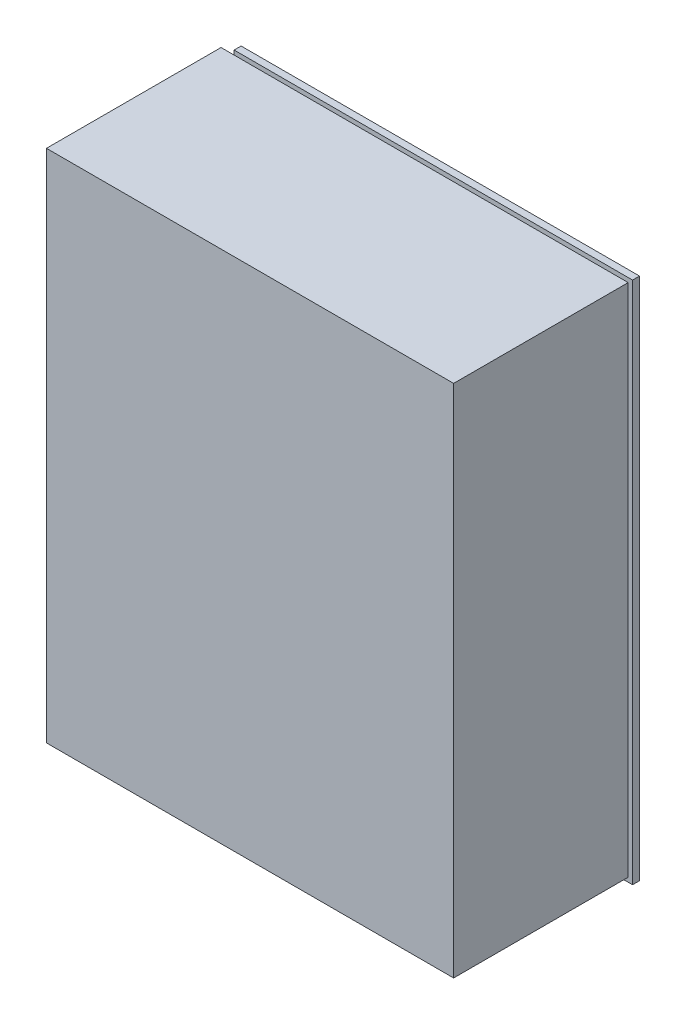
ISO-10303-21;
HEADER;
FILE_DESCRIPTION(('STEP AP214'),'2;1');
FILE_NAME('part.step','',(''),(''),'','','');
FILE_SCHEMA(('AUTOMOTIVE_DESIGN { 1 0 10303 214 1 1 1 1 }'));
ENDSEC;
DATA;
#1=APPLICATION_CONTEXT('core data for automotive mechanical design processes');
#2=APPLICATION_PROTOCOL_DEFINITION('international standard','automotive_design',2000,#1);
#3=PRODUCT_CONTEXT('',#1,'mechanical');
#4=PRODUCT('Part','Part','',(#3));
#5=PRODUCT_RELATED_PRODUCT_CATEGORY('part','',(#4));
#6=PRODUCT_DEFINITION_FORMATION('','',#4);
#7=PRODUCT_DEFINITION_CONTEXT('part definition',#1,'design');
#8=PRODUCT_DEFINITION('design','',#6,#7);
#9=PRODUCT_DEFINITION_SHAPE('','',#8);
#10=(LENGTH_UNIT() NAMED_UNIT(*) SI_UNIT(.MILLI.,.METRE.));
#11=(NAMED_UNIT(*) PLANE_ANGLE_UNIT() SI_UNIT($,.RADIAN.));
#12=(NAMED_UNIT(*) SI_UNIT($,.STERADIAN.) SOLID_ANGLE_UNIT());
#13=UNCERTAINTY_MEASURE_WITH_UNIT(LENGTH_MEASURE(1.E-05),#10,'distance_accuracy_value','');
#14=(GEOMETRIC_REPRESENTATION_CONTEXT(3) GLOBAL_UNCERTAINTY_ASSIGNED_CONTEXT((#13)) GLOBAL_UNIT_ASSIGNED_CONTEXT((#10,
#11,#12)) REPRESENTATION_CONTEXT('',''));
#15=CARTESIAN_POINT('',(0.,0.,0.));
#16=DIRECTION('',(0.,0.,1.));
#17=DIRECTION('',(1.,0.,0.));
#18=AXIS2_PLACEMENT_3D('',#15,#16,#17);
#19=CARTESIAN_POINT('',(46.65,59.,1.6));
#20=DIRECTION('',(0.,1.,0.));
#21=DIRECTION('',(0.,0.,1.));
#22=AXIS2_PLACEMENT_3D('',#19,#20,#21);
#23=PLANE('',#22);
#24=DIRECTION('',(-1.,0.,0.));
#25=VECTOR('',#24,1.);
#26=CARTESIAN_POINT('',(0.,59.,41.6));
#27=LINE('',#26,#25);
#28=CARTESIAN_POINT('',(46.65,59.,41.6));
#29=VERTEX_POINT('',#28);
#30=CARTESIAN_POINT('',(-46.65,59.,41.6));
#31=VERTEX_POINT('',#30);
#32=EDGE_CURVE('E150',#29,#31,#27,.T.);
#33=ORIENTED_EDGE('',*,*,#32,.F.);
#34=DIRECTION('',(0.,0.,1.));
#35=VECTOR('',#34,1.);
#36=CARTESIAN_POINT('',(46.65,59.,1.6));
#37=LINE('',#36,#35);
#38=CARTESIAN_POINT('',(46.65,59.,1.6));
#39=VERTEX_POINT('',#38);
#40=EDGE_CURVE('E185',#39,#29,#37,.T.);
#41=ORIENTED_EDGE('',*,*,#40,.F.);
#42=DIRECTION('',(-1.,0.,0.));
#43=VECTOR('',#42,1.);
#44=CARTESIAN_POINT('',(0.,59.,1.6));
#45=LINE('',#44,#43);
#46=CARTESIAN_POINT('',(-46.65,59.,1.6));
#47=VERTEX_POINT('',#46);
#48=EDGE_CURVE('E96',#39,#47,#45,.T.);
#49=ORIENTED_EDGE('',*,*,#48,.T.);
#50=DIRECTION('',(0.,0.,1.));
#51=VECTOR('',#50,1.);
#52=CARTESIAN_POINT('',(-46.65,59.,1.6));
#53=LINE('',#52,#51);
#54=EDGE_CURVE('E184',#47,#31,#53,.T.);
#55=ORIENTED_EDGE('',*,*,#54,.T.);
#56=EDGE_LOOP('',(#33,#41,#49,#55));
#57=FACE_BOUND('',#56,.T.);
#58=ADVANCED_FACE('F92',(#57),#23,.T.);
#59=CARTESIAN_POINT('',(46.65,-59.,1.6));
#60=DIRECTION('',(1.,0.,0.));
#61=DIRECTION('',(0.,0.,-1.));
#62=AXIS2_PLACEMENT_3D('',#59,#60,#61);
#63=PLANE('',#62);
#64=DIRECTION('',(0.,1.,0.));
#65=VECTOR('',#64,1.);
#66=CARTESIAN_POINT('',(46.65,0.,41.6));
#67=LINE('',#66,#65);
#68=CARTESIAN_POINT('',(46.65,-59.,41.6));
#69=VERTEX_POINT('',#68);
#70=EDGE_CURVE('E158',#69,#29,#67,.T.);
#71=ORIENTED_EDGE('',*,*,#70,.F.);
#72=DIRECTION('',(0.,0.,1.));
#73=VECTOR('',#72,1.);
#74=CARTESIAN_POINT('',(46.65,-59.,1.6));
#75=LINE('',#74,#73);
#76=CARTESIAN_POINT('',(46.65,-59.,1.6));
#77=VERTEX_POINT('',#76);
#78=EDGE_CURVE('E136',#77,#69,#75,.T.);
#79=ORIENTED_EDGE('',*,*,#78,.F.);
#80=DIRECTION('',(0.,1.,0.));
#81=VECTOR('',#80,1.);
#82=CARTESIAN_POINT('',(46.65,0.,1.6));
#83=LINE('',#82,#81);
#84=EDGE_CURVE('E163',#77,#39,#83,.T.);
#85=ORIENTED_EDGE('',*,*,#84,.T.);
#86=ORIENTED_EDGE('',*,*,#40,.T.);
#87=EDGE_LOOP('',(#71,#79,#85,#86));
#88=FACE_BOUND('',#87,.T.);
#89=ADVANCED_FACE('F187',(#88),#63,.T.);
#90=CARTESIAN_POINT('',(-46.65,-59.,1.6));
#91=DIRECTION('',(0.,-1.,0.));
#92=DIRECTION('',(0.,0.,-1.));
#93=AXIS2_PLACEMENT_3D('',#90,#91,#92);
#94=PLANE('',#93);
#95=DIRECTION('',(1.,0.,0.));
#96=VECTOR('',#95,1.);
#97=CARTESIAN_POINT('',(0.,-59.,41.6));
#98=LINE('',#97,#96);
#99=CARTESIAN_POINT('',(-46.65,-59.,41.6));
#100=VERTEX_POINT('',#99);
#101=EDGE_CURVE('E130',#100,#69,#98,.T.);
#102=ORIENTED_EDGE('',*,*,#101,.F.);
#103=DIRECTION('',(0.,0.,1.));
#104=VECTOR('',#103,1.);
#105=CARTESIAN_POINT('',(-46.65,-59.,1.6));
#106=LINE('',#105,#104);
#107=CARTESIAN_POINT('',(-46.65,-59.,1.6));
#108=VERTEX_POINT('',#107);
#109=EDGE_CURVE('E134',#108,#100,#106,.T.);
#110=ORIENTED_EDGE('',*,*,#109,.F.);
#111=DIRECTION('',(1.,0.,0.));
#112=VECTOR('',#111,1.);
#113=CARTESIAN_POINT('',(0.,-59.,1.6));
#114=LINE('',#113,#112);
#115=EDGE_CURVE('E103',#108,#77,#114,.T.);
#116=ORIENTED_EDGE('',*,*,#115,.T.);
#117=ORIENTED_EDGE('',*,*,#78,.T.);
#118=EDGE_LOOP('',(#102,#110,#116,#117));
#119=FACE_BOUND('',#118,.T.);
#120=ADVANCED_FACE('F132',(#119),#94,.T.);
#121=CARTESIAN_POINT('',(-46.65,59.,1.6));
#122=DIRECTION('',(-1.,0.,0.));
#123=DIRECTION('',(0.,0.,1.));
#124=AXIS2_PLACEMENT_3D('',#121,#122,#123);
#125=PLANE('',#124);
#126=DIRECTION('',(0.,-1.,0.));
#127=VECTOR('',#126,1.);
#128=CARTESIAN_POINT('',(-46.65,0.,41.6));
#129=LINE('',#128,#127);
#130=EDGE_CURVE('E141',#31,#100,#129,.T.);
#131=ORIENTED_EDGE('',*,*,#130,.F.);
#132=ORIENTED_EDGE('',*,*,#54,.F.);
#133=DIRECTION('',(0.,-1.,0.));
#134=VECTOR('',#133,1.);
#135=CARTESIAN_POINT('',(-46.65,0.,1.6));
#136=LINE('',#135,#134);
#137=EDGE_CURVE('E14',#47,#108,#136,.T.);
#138=ORIENTED_EDGE('',*,*,#137,.T.);
#139=ORIENTED_EDGE('',*,*,#109,.T.);
#140=EDGE_LOOP('',(#131,#132,#138,#139));
#141=FACE_BOUND('',#140,.T.);
#142=ADVANCED_FACE('F144',(#141),#125,.T.);
#143=CARTESIAN_POINT('',(46.65,-59.,41.6));
#144=DIRECTION('',(0.,0.,1.));
#145=DIRECTION('',(0.,1.,0.));
#146=AXIS2_PLACEMENT_3D('',#143,#144,#145);
#147=PLANE('',#146);
#148=ORIENTED_EDGE('',*,*,#70,.T.);
#149=ORIENTED_EDGE('',*,*,#32,.T.);
#150=ORIENTED_EDGE('',*,*,#130,.T.);
#151=ORIENTED_EDGE('',*,*,#101,.T.);
#152=EDGE_LOOP('',(#148,#149,#150,#151));
#153=FACE_BOUND('',#152,.T.);
#154=ADVANCED_FACE('F149',(#153),#147,.T.);
#155=CARTESIAN_POINT('',(-46.65,59.,1.6));
#156=DIRECTION('',(0.,0.,1.));
#157=DIRECTION('',(0.,-1.,0.));
#158=AXIS2_PLACEMENT_3D('',#155,#156,#157);
#159=PLANE('',#158);
#160=ORIENTED_EDGE('',*,*,#137,.F.);
#161=ORIENTED_EDGE('',*,*,#48,.F.);
#162=ORIENTED_EDGE('',*,*,#84,.F.);
#163=ORIENTED_EDGE('',*,*,#115,.F.);
#164=EDGE_LOOP('',(#160,#161,#162,#163));
#165=FACE_BOUND('',#164,.T.);
#166=ADVANCED_FACE('F94',(#165),#159,.F.);
#167=OPEN_SHELL('',(#58,#89,#120,#142,#154,#166));
#168=SHELL_BASED_SURFACE_MODEL('B2',(#167));
#169=CARTESIAN_POINT('',(47.65,-60.,1.6));
#170=DIRECTION('',(-1.,0.,0.));
#171=DIRECTION('',(0.,0.,1.));
#172=AXIS2_PLACEMENT_3D('',#169,#170,#171);
#173=PLANE('',#172);
#174=DIRECTION('',(0.,1.,0.));
#175=VECTOR('',#174,1.);
#176=CARTESIAN_POINT('',(47.65,-60.,0.));
#177=LINE('',#176,#175);
#178=CARTESIAN_POINT('',(47.65,-60.,0.));
#179=VERTEX_POINT('',#178);
#180=CARTESIAN_POINT('',(47.65,60.,0.));
#181=VERTEX_POINT('',#180);
#182=EDGE_CURVE('E349',#179,#181,#177,.T.);
#183=ORIENTED_EDGE('',*,*,#182,.T.);
#184=DIRECTION('',(0.,0.,-1.));
#185=VECTOR('',#184,1.);
#186=CARTESIAN_POINT('',(47.65,60.,1.6));
#187=LINE('',#186,#185);
#188=CARTESIAN_POINT('',(47.65,60.,1.6));
#189=VERTEX_POINT('',#188);
#190=EDGE_CURVE('E90',#189,#181,#187,.T.);
#191=ORIENTED_EDGE('',*,*,#190,.F.);
#192=DIRECTION('',(0.,1.,0.));
#193=VECTOR('',#192,1.);
#194=CARTESIAN_POINT('',(47.65,-60.,1.6));
#195=LINE('',#194,#193);
#196=CARTESIAN_POINT('',(47.65,-60.,1.6));
#197=VERTEX_POINT('',#196);
#198=EDGE_CURVE('E350',#197,#189,#195,.T.);
#199=ORIENTED_EDGE('',*,*,#198,.F.);
#200=DIRECTION('',(0.,0.,-1.));
#201=VECTOR('',#200,1.);
#202=CARTESIAN_POINT('',(47.65,-60.,1.6));
#203=LINE('',#202,#201);
#204=EDGE_CURVE('E270',#197,#179,#203,.T.);
#205=ORIENTED_EDGE('',*,*,#204,.T.);
#206=EDGE_LOOP('',(#183,#191,#199,#205));
#207=FACE_BOUND('',#206,.T.);
#208=ADVANCED_FACE('F263',(#207),#173,.F.);
#209=CARTESIAN_POINT('',(-47.65,60.,1.6));
#210=DIRECTION('',(0.,-1.,0.));
#211=DIRECTION('',(0.,0.,-1.));
#212=AXIS2_PLACEMENT_3D('',#209,#210,#211);
#213=PLANE('',#212);
#214=DIRECTION('',(-1.,0.,0.));
#215=VECTOR('',#214,1.);
#216=CARTESIAN_POINT('',(-47.65,60.,0.));
#217=LINE('',#216,#215);
#218=CARTESIAN_POINT('',(-43.65,60.,0.));
#219=VERTEX_POINT('',#218);
#220=EDGE_CURVE('E357',#181,#219,#217,.T.);
#221=ORIENTED_EDGE('',*,*,#220,.T.);
#222=DIRECTION('',(0.,0.,1.));
#223=VECTOR('',#222,1.);
#224=CARTESIAN_POINT('',(-43.65,60.,0.));
#225=LINE('',#224,#223);
#226=CARTESIAN_POINT('',(-43.65,60.,1.6));
#227=VERTEX_POINT('',#226);
#228=EDGE_CURVE('E369',#219,#227,#225,.T.);
#229=ORIENTED_EDGE('',*,*,#228,.T.);
#230=DIRECTION('',(-1.,0.,0.));
#231=VECTOR('',#230,1.);
#232=CARTESIAN_POINT('',(-47.65,60.,1.6));
#233=LINE('',#232,#231);
#234=EDGE_CURVE('E354',#189,#227,#233,.T.);
#235=ORIENTED_EDGE('',*,*,#234,.F.);
#236=ORIENTED_EDGE('',*,*,#190,.T.);
#237=EDGE_LOOP('',(#221,#229,#235,#236));
#238=FACE_BOUND('',#237,.T.);
#239=ADVANCED_FACE('F373',(#238),#213,.F.);
#240=CARTESIAN_POINT('',(-47.65,-60.,1.6));
#241=DIRECTION('',(1.,0.,0.));
#242=DIRECTION('',(0.,0.,-1.));
#243=AXIS2_PLACEMENT_3D('',#240,#241,#242);
#244=PLANE('',#243);
#245=DIRECTION('',(0.,-1.,0.));
#246=VECTOR('',#245,1.);
#247=CARTESIAN_POINT('',(-47.65,-60.,0.));
#248=LINE('',#247,#246);
#249=CARTESIAN_POINT('',(-47.65,53.,0.));
#250=VERTEX_POINT('',#249);
#251=CARTESIAN_POINT('',(-47.65,-56.,0.));
#252=VERTEX_POINT('',#251);
#253=EDGE_CURVE('E351',#250,#252,#248,.T.);
#254=ORIENTED_EDGE('',*,*,#253,.T.);
#255=DIRECTION('',(0.,0.,1.));
#256=VECTOR('',#255,1.);
#257=CARTESIAN_POINT('',(-47.65,-56.,0.));
#258=LINE('',#257,#256);
#259=CARTESIAN_POINT('',(-47.65,-56.,1.6));
#260=VERTEX_POINT('',#259);
#261=EDGE_CURVE('E390',#252,#260,#258,.T.);
#262=ORIENTED_EDGE('',*,*,#261,.T.);
#263=DIRECTION('',(0.,-1.,0.));
#264=VECTOR('',#263,1.);
#265=CARTESIAN_POINT('',(-47.65,-60.,1.6));
#266=LINE('',#265,#264);
#267=CARTESIAN_POINT('',(-47.65,53.,1.6));
#268=VERTEX_POINT('',#267);
#269=EDGE_CURVE('E362',#268,#260,#266,.T.);
#270=ORIENTED_EDGE('',*,*,#269,.F.);
#271=DIRECTION('',(0.,0.,1.));
#272=VECTOR('',#271,1.);
#273=CARTESIAN_POINT('',(-47.65,53.,0.));
#274=LINE('',#273,#272);
#275=EDGE_CURVE('E379',#250,#268,#274,.T.);
#276=ORIENTED_EDGE('',*,*,#275,.F.);
#277=EDGE_LOOP('',(#254,#262,#270,#276));
#278=FACE_BOUND('',#277,.T.);
#279=ADVANCED_FACE('F400',(#278),#244,.F.);
#280=CARTESIAN_POINT('',(-47.65,-60.,1.6));
#281=DIRECTION('',(0.,1.,0.));
#282=DIRECTION('',(0.,0.,1.));
#283=AXIS2_PLACEMENT_3D('',#280,#281,#282);
#284=PLANE('',#283);
#285=DIRECTION('',(1.,0.,0.));
#286=VECTOR('',#285,1.);
#287=CARTESIAN_POINT('',(-47.65,-60.,1.6));
#288=LINE('',#287,#286);
#289=CARTESIAN_POINT('',(-41.65,-60.,1.6));
#290=VERTEX_POINT('',#289);
#291=EDGE_CURVE('E343',#290,#197,#288,.T.);
#292=ORIENTED_EDGE('',*,*,#291,.F.);
#293=DIRECTION('',(0.,0.,1.));
#294=VECTOR('',#293,1.);
#295=CARTESIAN_POINT('',(-41.65,-60.,0.));
#296=LINE('',#295,#294);
#297=CARTESIAN_POINT('',(-41.65,-60.,0.));
#298=VERTEX_POINT('',#297);
#299=EDGE_CURVE('E330',#298,#290,#296,.T.);
#300=ORIENTED_EDGE('',*,*,#299,.F.);
#301=DIRECTION('',(1.,0.,0.));
#302=VECTOR('',#301,1.);
#303=CARTESIAN_POINT('',(-47.65,-60.,0.));
#304=LINE('',#303,#302);
#305=EDGE_CURVE('E341',#298,#179,#304,.T.);
#306=ORIENTED_EDGE('',*,*,#305,.T.);
#307=ORIENTED_EDGE('',*,*,#204,.F.);
#308=EDGE_LOOP('',(#292,#300,#306,#307));
#309=FACE_BOUND('',#308,.T.);
#310=ADVANCED_FACE('F339',(#309),#284,.F.);
#311=CARTESIAN_POINT('',(0.,0.,1.6));
#312=DIRECTION('',(0.,0.,-1.));
#313=DIRECTION('',(-1.,0.,0.));
#314=AXIS2_PLACEMENT_3D('',#311,#312,#313);
#315=PLANE('',#314);
#316=CARTESIAN_POINT('',(-38.35,52.,1.6));
#317=DIRECTION('',(0.,0.,1.));
#318=DIRECTION('',(1.,0.,0.));
#319=AXIS2_PLACEMENT_3D('',#316,#317,#318);
#320=CIRCLE('',#319,1.8);
#321=CARTESIAN_POINT('',(-36.55,52.,1.6));
#322=VERTEX_POINT('',#321);
#323=EDGE_CURVE('E465',#322,#322,#320,.T.);
#324=ORIENTED_EDGE('',*,*,#323,.F.);
#325=EDGE_LOOP('',(#324));
#326=FACE_BOUND('',#325,.T.);
#327=CARTESIAN_POINT('',(41.65,52.,1.6));
#328=DIRECTION('',(0.,0.,1.));
#329=DIRECTION('',(1.,0.,0.));
#330=AXIS2_PLACEMENT_3D('',#327,#328,#329);
#331=CIRCLE('',#330,1.8);
#332=CARTESIAN_POINT('',(43.45,52.,1.6));
#333=VERTEX_POINT('',#332);
#334=EDGE_CURVE('E471',#333,#333,#331,.T.);
#335=ORIENTED_EDGE('',*,*,#334,.F.);
#336=EDGE_LOOP('',(#335));
#337=FACE_BOUND('',#336,.T.);
#338=CARTESIAN_POINT('',(41.65,-56.,1.6));
#339=DIRECTION('',(0.,0.,1.));
#340=DIRECTION('',(1.,0.,0.));
#341=AXIS2_PLACEMENT_3D('',#338,#339,#340);
#342=CIRCLE('',#341,1.79999999999999);
#343=CARTESIAN_POINT('',(43.45,-56.,1.6));
#344=VERTEX_POINT('',#343);
#345=EDGE_CURVE('E452',#344,#344,#342,.T.);
#346=ORIENTED_EDGE('',*,*,#345,.F.);
#347=EDGE_LOOP('',(#346));
#348=FACE_BOUND('',#347,.T.);
#349=CARTESIAN_POINT('',(-43.35,-53.,1.6));
#350=DIRECTION('',(0.,0.,1.));
#351=DIRECTION('',(1.,0.,0.));
#352=AXIS2_PLACEMENT_3D('',#349,#350,#351);
#353=CIRCLE('',#352,1.79999999999999);
#354=CARTESIAN_POINT('',(-41.55,-53.,1.6));
#355=VERTEX_POINT('',#354);
#356=EDGE_CURVE('E449',#355,#355,#353,.T.);
#357=ORIENTED_EDGE('',*,*,#356,.F.);
#358=EDGE_LOOP('',(#357));
#359=FACE_BOUND('',#358,.T.);
#360=ORIENTED_EDGE('',*,*,#269,.T.);
#361=DIRECTION('',(-1.,0.,0.));
#362=VECTOR('',#361,1.);
#363=CARTESIAN_POINT('',(-47.65,-56.,1.6));
#364=LINE('',#363,#362);
#365=CARTESIAN_POINT('',(-41.65,-56.,1.6));
#366=VERTEX_POINT('',#365);
#367=EDGE_CURVE('E335',#366,#260,#364,.T.);
#368=ORIENTED_EDGE('',*,*,#367,.F.);
#369=DIRECTION('',(0.,1.,0.));
#370=VECTOR('',#369,1.);
#371=CARTESIAN_POINT('',(-41.65,-60.,1.6));
#372=LINE('',#371,#370);
#373=EDGE_CURVE('E456',#290,#366,#372,.T.);
#374=ORIENTED_EDGE('',*,*,#373,.F.);
#375=ORIENTED_EDGE('',*,*,#291,.T.);
#376=ORIENTED_EDGE('',*,*,#198,.T.);
#377=ORIENTED_EDGE('',*,*,#234,.T.);
#378=DIRECTION('',(0.,1.,0.));
#379=VECTOR('',#378,1.);
#380=CARTESIAN_POINT('',(-43.65,60.,1.6));
#381=LINE('',#380,#379);
#382=CARTESIAN_POINT('',(-43.65,53.,1.6));
#383=VERTEX_POINT('',#382);
#384=EDGE_CURVE('E383',#383,#227,#381,.T.);
#385=ORIENTED_EDGE('',*,*,#384,.F.);
#386=DIRECTION('',(1.,0.,0.));
#387=VECTOR('',#386,1.);
#388=CARTESIAN_POINT('',(-47.65,53.,1.6));
#389=LINE('',#388,#387);
#390=EDGE_CURVE('E387',#268,#383,#389,.T.);
#391=ORIENTED_EDGE('',*,*,#390,.F.);
#392=EDGE_LOOP('',(#360,#368,#374,#375,#376,#377,#385,#391));
#393=FACE_BOUND('',#392,.T.);
#394=ADVANCED_FACE('F394',(#326,#337,#348,#359,#393),#315,.F.);
#395=CARTESIAN_POINT('',(0.,0.,0.));
#396=DIRECTION('',(0.,0.,-1.));
#397=DIRECTION('',(-1.,0.,0.));
#398=AXIS2_PLACEMENT_3D('',#395,#396,#397);
#399=PLANE('',#398);
#400=DIRECTION('',(-1.,0.,0.));
#401=VECTOR('',#400,1.);
#402=CARTESIAN_POINT('',(-47.65,-56.,0.));
#403=LINE('',#402,#401);
#404=CARTESIAN_POINT('',(-41.65,-56.,0.));
#405=VERTEX_POINT('',#404);
#406=EDGE_CURVE('E277',#405,#252,#403,.T.);
#407=ORIENTED_EDGE('',*,*,#406,.T.);
#408=ORIENTED_EDGE('',*,*,#253,.F.);
#409=DIRECTION('',(1.,0.,0.));
#410=VECTOR('',#409,1.);
#411=CARTESIAN_POINT('',(-47.65,53.,0.));
#412=LINE('',#411,#410);
#413=CARTESIAN_POINT('',(-43.65,53.,0.));
#414=VERTEX_POINT('',#413);
#415=EDGE_CURVE('E378',#250,#414,#412,.T.);
#416=ORIENTED_EDGE('',*,*,#415,.T.);
#417=DIRECTION('',(0.,1.,0.));
#418=VECTOR('',#417,1.);
#419=CARTESIAN_POINT('',(-43.65,60.,0.));
#420=LINE('',#419,#418);
#421=EDGE_CURVE('E285',#414,#219,#420,.T.);
#422=ORIENTED_EDGE('',*,*,#421,.T.);
#423=ORIENTED_EDGE('',*,*,#220,.F.);
#424=ORIENTED_EDGE('',*,*,#182,.F.);
#425=ORIENTED_EDGE('',*,*,#305,.F.);
#426=DIRECTION('',(0.,1.,0.));
#427=VECTOR('',#426,1.);
#428=CARTESIAN_POINT('',(-41.65,-60.,0.));
#429=LINE('',#428,#427);
#430=EDGE_CURVE('E326',#298,#405,#429,.T.);
#431=ORIENTED_EDGE('',*,*,#430,.T.);
#432=EDGE_LOOP('',(#407,#408,#416,#422,#423,#424,#425,#431));
#433=FACE_BOUND('',#432,.T.);
#434=CARTESIAN_POINT('',(-38.35,52.,0.));
#435=DIRECTION('',(0.,0.,1.));
#436=DIRECTION('',(1.,0.,0.));
#437=AXIS2_PLACEMENT_3D('',#434,#435,#436);
#438=CIRCLE('',#437,1.8);
#439=CARTESIAN_POINT('',(-36.55,52.,0.));
#440=VERTEX_POINT('',#439);
#441=EDGE_CURVE('E458',#440,#440,#438,.T.);
#442=ORIENTED_EDGE('',*,*,#441,.T.);
#443=EDGE_LOOP('',(#442));
#444=FACE_BOUND('',#443,.T.);
#445=CARTESIAN_POINT('',(41.65,52.,0.));
#446=DIRECTION('',(0.,0.,1.));
#447=DIRECTION('',(1.,0.,0.));
#448=AXIS2_PLACEMENT_3D('',#445,#446,#447);
#449=CIRCLE('',#448,1.8);
#450=CARTESIAN_POINT('',(43.45,52.,0.));
#451=VERTEX_POINT('',#450);
#452=EDGE_CURVE('E468',#451,#451,#449,.T.);
#453=ORIENTED_EDGE('',*,*,#452,.T.);
#454=EDGE_LOOP('',(#453));
#455=FACE_BOUND('',#454,.T.);
#456=CARTESIAN_POINT('',(41.65,-56.,0.));
#457=DIRECTION('',(0.,0.,1.));
#458=DIRECTION('',(1.,0.,0.));
#459=AXIS2_PLACEMENT_3D('',#456,#457,#458);
#460=CIRCLE('',#459,1.79999999999999);
#461=CARTESIAN_POINT('',(43.45,-56.,0.));
#462=VERTEX_POINT('',#461);
#463=EDGE_CURVE('E474',#462,#462,#460,.T.);
#464=ORIENTED_EDGE('',*,*,#463,.T.);
#465=EDGE_LOOP('',(#464));
#466=FACE_BOUND('',#465,.T.);
#467=CARTESIAN_POINT('',(-43.35,-53.,0.));
#468=DIRECTION('',(0.,0.,1.));
#469=DIRECTION('',(1.,0.,0.));
#470=AXIS2_PLACEMENT_3D('',#467,#468,#469);
#471=CIRCLE('',#470,1.79999999999999);
#472=CARTESIAN_POINT('',(-41.55,-53.,0.));
#473=VERTEX_POINT('',#472);
#474=EDGE_CURVE('E446',#473,#473,#471,.T.);
#475=ORIENTED_EDGE('',*,*,#474,.T.);
#476=EDGE_LOOP('',(#475));
#477=FACE_BOUND('',#476,.T.);
#478=ADVANCED_FACE('F346',(#433,#444,#455,#466,#477),#399,.T.);
#479=CARTESIAN_POINT('',(-43.65,60.,0.));
#480=DIRECTION('',(1.,0.,0.));
#481=DIRECTION('',(0.,0.,-1.));
#482=AXIS2_PLACEMENT_3D('',#479,#480,#481);
#483=PLANE('',#482);
#484=ORIENTED_EDGE('',*,*,#384,.T.);
#485=ORIENTED_EDGE('',*,*,#228,.F.);
#486=ORIENTED_EDGE('',*,*,#421,.F.);
#487=DIRECTION('',(0.,0.,1.));
#488=VECTOR('',#487,1.);
#489=CARTESIAN_POINT('',(-43.65,53.,0.));
#490=LINE('',#489,#488);
#491=EDGE_CURVE('E381',#414,#383,#490,.T.);
#492=ORIENTED_EDGE('',*,*,#491,.T.);
#493=EDGE_LOOP('',(#484,#485,#486,#492));
#494=FACE_BOUND('',#493,.T.);
#495=ADVANCED_FACE('F411',(#494),#483,.F.);
#496=CARTESIAN_POINT('',(-47.65,53.,0.));
#497=DIRECTION('',(0.,-1.,0.));
#498=DIRECTION('',(0.,0.,-1.));
#499=AXIS2_PLACEMENT_3D('',#496,#497,#498);
#500=PLANE('',#499);
#501=ORIENTED_EDGE('',*,*,#390,.T.);
#502=ORIENTED_EDGE('',*,*,#491,.F.);
#503=ORIENTED_EDGE('',*,*,#415,.F.);
#504=ORIENTED_EDGE('',*,*,#275,.T.);
#505=EDGE_LOOP('',(#501,#502,#503,#504));
#506=FACE_BOUND('',#505,.T.);
#507=ADVANCED_FACE('F415',(#506),#500,.F.);
#508=CARTESIAN_POINT('',(-43.35,-53.,0.));
#509=DIRECTION('',(0.,0.,1.));
#510=DIRECTION('',(1.,0.,0.));
#511=AXIS2_PLACEMENT_3D('',#508,#509,#510);
#512=CYLINDRICAL_SURFACE('',#511,1.79999999999999);
#513=ORIENTED_EDGE('',*,*,#474,.F.);
#514=EDGE_LOOP('',(#513));
#515=FACE_BOUND('',#514,.T.);
#516=ORIENTED_EDGE('',*,*,#356,.T.);
#517=EDGE_LOOP('',(#516));
#518=FACE_BOUND('',#517,.T.);
#519=ADVANCED_FACE('F418',(#515,#518),#512,.F.);
#520=CARTESIAN_POINT('',(41.65,-56.,0.));
#521=DIRECTION('',(0.,0.,1.));
#522=DIRECTION('',(1.,0.,0.));
#523=AXIS2_PLACEMENT_3D('',#520,#521,#522);
#524=CYLINDRICAL_SURFACE('',#523,1.79999999999999);
#525=ORIENTED_EDGE('',*,*,#463,.F.);
#526=EDGE_LOOP('',(#525));
#527=FACE_BOUND('',#526,.T.);
#528=ORIENTED_EDGE('',*,*,#345,.T.);
#529=EDGE_LOOP('',(#528));
#530=FACE_BOUND('',#529,.T.);
#531=ADVANCED_FACE('F422',(#527,#530),#524,.F.);
#532=CARTESIAN_POINT('',(41.65,52.,0.));
#533=DIRECTION('',(0.,0.,1.));
#534=DIRECTION('',(1.,0.,0.));
#535=AXIS2_PLACEMENT_3D('',#532,#533,#534);
#536=CYLINDRICAL_SURFACE('',#535,1.8);
#537=ORIENTED_EDGE('',*,*,#452,.F.);
#538=EDGE_LOOP('',(#537));
#539=FACE_BOUND('',#538,.T.);
#540=ORIENTED_EDGE('',*,*,#334,.T.);
#541=EDGE_LOOP('',(#540));
#542=FACE_BOUND('',#541,.T.);
#543=ADVANCED_FACE('F425',(#539,#542),#536,.F.);
#544=CARTESIAN_POINT('',(-38.35,52.,0.));
#545=DIRECTION('',(0.,0.,1.));
#546=DIRECTION('',(1.,0.,0.));
#547=AXIS2_PLACEMENT_3D('',#544,#545,#546);
#548=CYLINDRICAL_SURFACE('',#547,1.8);
#549=ORIENTED_EDGE('',*,*,#441,.F.);
#550=EDGE_LOOP('',(#549));
#551=FACE_BOUND('',#550,.T.);
#552=ORIENTED_EDGE('',*,*,#323,.T.);
#553=EDGE_LOOP('',(#552));
#554=FACE_BOUND('',#553,.T.);
#555=ADVANCED_FACE('F429',(#551,#554),#548,.F.);
#556=CARTESIAN_POINT('',(-47.65,-56.,0.));
#557=DIRECTION('',(0.,1.,0.));
#558=DIRECTION('',(0.,0.,1.));
#559=AXIS2_PLACEMENT_3D('',#556,#557,#558);
#560=PLANE('',#559);
#561=ORIENTED_EDGE('',*,*,#367,.T.);
#562=ORIENTED_EDGE('',*,*,#261,.F.);
#563=ORIENTED_EDGE('',*,*,#406,.F.);
#564=DIRECTION('',(0.,0.,1.));
#565=VECTOR('',#564,1.);
#566=CARTESIAN_POINT('',(-41.65,-56.,0.));
#567=LINE('',#566,#565);
#568=EDGE_CURVE('E332',#405,#366,#567,.T.);
#569=ORIENTED_EDGE('',*,*,#568,.T.);
#570=EDGE_LOOP('',(#561,#562,#563,#569));
#571=FACE_BOUND('',#570,.T.);
#572=ADVANCED_FACE('F433',(#571),#560,.F.);
#573=CARTESIAN_POINT('',(-41.65,-60.,0.));
#574=DIRECTION('',(1.,0.,0.));
#575=DIRECTION('',(0.,0.,-1.));
#576=AXIS2_PLACEMENT_3D('',#573,#574,#575);
#577=PLANE('',#576);
#578=ORIENTED_EDGE('',*,*,#373,.T.);
#579=ORIENTED_EDGE('',*,*,#568,.F.);
#580=ORIENTED_EDGE('',*,*,#430,.F.);
#581=ORIENTED_EDGE('',*,*,#299,.T.);
#582=EDGE_LOOP('',(#578,#579,#580,#581));
#583=FACE_BOUND('',#582,.T.);
#584=ADVANCED_FACE('F329',(#583),#577,.F.);
#585=CLOSED_SHELL('',(#208,#239,#279,#310,#394,#478,#495,#507,#519,#531,#543,#555,#572,#584));
#586=MANIFOLD_SOLID_BREP('B8',#585);
#587=ADVANCED_BREP_SHAPE_REPRESENTATION('',(#18,#586),#14);
#588=MANIFOLD_SURFACE_SHAPE_REPRESENTATION('',(#18,#168),#14);
#589=SHAPE_REPRESENTATION('',(#18),#14);
#590=SHAPE_DEFINITION_REPRESENTATION(#9,#589);
#591=SHAPE_REPRESENTATION_RELATIONSHIP('','',#589,#587);
#592=SHAPE_REPRESENTATION_RELATIONSHIP('','',#589,#588);
ENDSEC;
END-ISO-10303-21;
